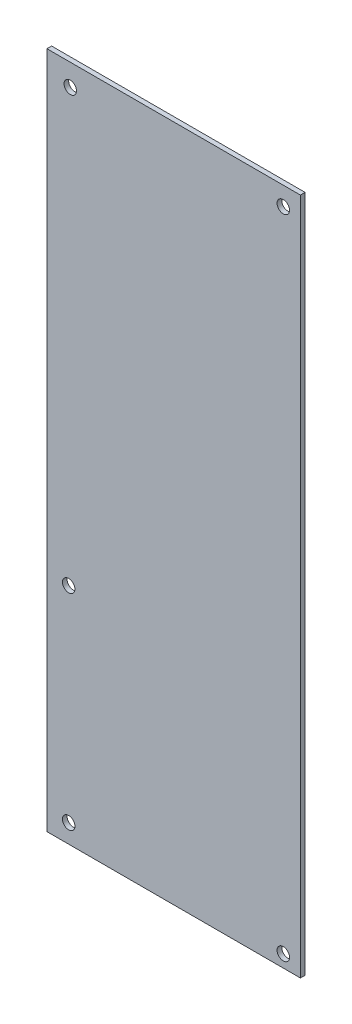
ISO-10303-21;
HEADER;
FILE_DESCRIPTION(('STEP AP214'),'2;1');
FILE_NAME('part.step','',(''),(''),'','','');
FILE_SCHEMA(('AUTOMOTIVE_DESIGN { 1 0 10303 214 1 1 1 1 }'));
ENDSEC;
DATA;
#1=APPLICATION_CONTEXT('core data for automotive mechanical design processes');
#2=APPLICATION_PROTOCOL_DEFINITION('international standard','automotive_design',2000,#1);
#3=PRODUCT_CONTEXT('',#1,'mechanical');
#4=PRODUCT('Part','Part','',(#3));
#5=PRODUCT_RELATED_PRODUCT_CATEGORY('part','',(#4));
#6=PRODUCT_DEFINITION_FORMATION('','',#4);
#7=PRODUCT_DEFINITION_CONTEXT('part definition',#1,'design');
#8=PRODUCT_DEFINITION('design','',#6,#7);
#9=PRODUCT_DEFINITION_SHAPE('','',#8);
#10=(LENGTH_UNIT() NAMED_UNIT(*) SI_UNIT(.MILLI.,.METRE.));
#11=(NAMED_UNIT(*) PLANE_ANGLE_UNIT() SI_UNIT($,.RADIAN.));
#12=(NAMED_UNIT(*) SI_UNIT($,.STERADIAN.) SOLID_ANGLE_UNIT());
#13=UNCERTAINTY_MEASURE_WITH_UNIT(LENGTH_MEASURE(1.E-05),#10,'distance_accuracy_value','');
#14=(GEOMETRIC_REPRESENTATION_CONTEXT(3) GLOBAL_UNCERTAINTY_ASSIGNED_CONTEXT((#13)) GLOBAL_UNIT_ASSIGNED_CONTEXT((#10,
#11,#12)) REPRESENTATION_CONTEXT('',''));
#15=CARTESIAN_POINT('',(0.,0.,0.));
#16=DIRECTION('',(0.,0.,1.));
#17=DIRECTION('',(1.,0.,0.));
#18=AXIS2_PLACEMENT_3D('',#15,#16,#17);
#19=CARTESIAN_POINT('',(0.,0.,1.5));
#20=DIRECTION('',(1.,0.,0.));
#21=DIRECTION('',(0.,0.,-1.));
#22=AXIS2_PLACEMENT_3D('',#19,#20,#21);
#23=PLANE('',#22);
#24=DIRECTION('',(0.,-1.,0.));
#25=VECTOR('',#24,1.);
#26=CARTESIAN_POINT('',(0.,0.,0.));
#27=LINE('',#26,#25);
#28=CARTESIAN_POINT('',(0.,218.,0.));
#29=VERTEX_POINT('',#28);
#30=CARTESIAN_POINT('',(0.,0.,0.));
#31=VERTEX_POINT('',#30);
#32=EDGE_CURVE('E96',#29,#31,#27,.T.);
#33=ORIENTED_EDGE('',*,*,#32,.T.);
#34=DIRECTION('',(0.,0.,-1.));
#35=VECTOR('',#34,1.);
#36=CARTESIAN_POINT('',(0.,0.,1.5));
#37=LINE('',#36,#35);
#38=CARTESIAN_POINT('',(0.,0.,1.5));
#39=VERTEX_POINT('',#38);
#40=EDGE_CURVE('E11',#39,#31,#37,.T.);
#41=ORIENTED_EDGE('',*,*,#40,.F.);
#42=DIRECTION('',(0.,-1.,0.));
#43=VECTOR('',#42,1.);
#44=CARTESIAN_POINT('',(0.,0.,1.5));
#45=LINE('',#44,#43);
#46=CARTESIAN_POINT('',(0.,218.,1.5));
#47=VERTEX_POINT('',#46);
#48=EDGE_CURVE('E84',#47,#39,#45,.T.);
#49=ORIENTED_EDGE('',*,*,#48,.F.);
#50=DIRECTION('',(0.,0.,-1.));
#51=VECTOR('',#50,1.);
#52=CARTESIAN_POINT('',(0.,218.,1.5));
#53=LINE('',#52,#51);
#54=EDGE_CURVE('E92',#47,#29,#53,.T.);
#55=ORIENTED_EDGE('',*,*,#54,.T.);
#56=EDGE_LOOP('',(#33,#41,#49,#55));
#57=FACE_BOUND('',#56,.T.);
#58=ADVANCED_FACE('F33',(#57),#23,.F.);
#59=CARTESIAN_POINT('',(0.,0.,1.5));
#60=DIRECTION('',(0.,1.,0.));
#61=DIRECTION('',(0.,0.,1.));
#62=AXIS2_PLACEMENT_3D('',#59,#60,#61);
#63=PLANE('',#62);
#64=DIRECTION('',(1.,0.,0.));
#65=VECTOR('',#64,1.);
#66=CARTESIAN_POINT('',(0.,0.,0.));
#67=LINE('',#66,#65);
#68=CARTESIAN_POINT('',(81.5,0.,0.));
#69=VERTEX_POINT('',#68);
#70=EDGE_CURVE('E88',#31,#69,#67,.T.);
#71=ORIENTED_EDGE('',*,*,#70,.T.);
#72=DIRECTION('',(0.,0.,-1.));
#73=VECTOR('',#72,1.);
#74=CARTESIAN_POINT('',(81.5,0.,1.5));
#75=LINE('',#74,#73);
#76=CARTESIAN_POINT('',(81.5,0.,1.5));
#77=VERTEX_POINT('',#76);
#78=EDGE_CURVE('E41',#77,#69,#75,.T.);
#79=ORIENTED_EDGE('',*,*,#78,.F.);
#80=DIRECTION('',(1.,0.,0.));
#81=VECTOR('',#80,1.);
#82=CARTESIAN_POINT('',(0.,0.,1.5));
#83=LINE('',#82,#81);
#84=EDGE_CURVE('E79',#39,#77,#83,.T.);
#85=ORIENTED_EDGE('',*,*,#84,.F.);
#86=ORIENTED_EDGE('',*,*,#40,.T.);
#87=EDGE_LOOP('',(#71,#79,#85,#86));
#88=FACE_BOUND('',#87,.T.);
#89=ADVANCED_FACE('F87',(#88),#63,.F.);
#90=CARTESIAN_POINT('',(81.5,0.,1.5));
#91=DIRECTION('',(-1.,0.,0.));
#92=DIRECTION('',(0.,0.,1.));
#93=AXIS2_PLACEMENT_3D('',#90,#91,#92);
#94=PLANE('',#93);
#95=DIRECTION('',(0.,1.,0.));
#96=VECTOR('',#95,1.);
#97=CARTESIAN_POINT('',(81.5,0.,0.));
#98=LINE('',#97,#96);
#99=CARTESIAN_POINT('',(81.5,218.,0.));
#100=VERTEX_POINT('',#99);
#101=EDGE_CURVE('E66',#69,#100,#98,.T.);
#102=ORIENTED_EDGE('',*,*,#101,.T.);
#103=DIRECTION('',(0.,0.,-1.));
#104=VECTOR('',#103,1.);
#105=CARTESIAN_POINT('',(81.5,218.,1.5));
#106=LINE('',#105,#104);
#107=CARTESIAN_POINT('',(81.5,218.,1.5));
#108=VERTEX_POINT('',#107);
#109=EDGE_CURVE('E89',#108,#100,#106,.T.);
#110=ORIENTED_EDGE('',*,*,#109,.F.);
#111=DIRECTION('',(0.,1.,0.));
#112=VECTOR('',#111,1.);
#113=CARTESIAN_POINT('',(81.5,0.,1.5));
#114=LINE('',#113,#112);
#115=EDGE_CURVE('E82',#77,#108,#114,.T.);
#116=ORIENTED_EDGE('',*,*,#115,.F.);
#117=ORIENTED_EDGE('',*,*,#78,.T.);
#118=EDGE_LOOP('',(#102,#110,#116,#117));
#119=FACE_BOUND('',#118,.T.);
#120=ADVANCED_FACE('F90',(#119),#94,.F.);
#121=CARTESIAN_POINT('',(0.,218.,1.5));
#122=DIRECTION('',(0.,-1.,0.));
#123=DIRECTION('',(0.,0.,-1.));
#124=AXIS2_PLACEMENT_3D('',#121,#122,#123);
#125=PLANE('',#124);
#126=DIRECTION('',(-1.,0.,0.));
#127=VECTOR('',#126,1.);
#128=CARTESIAN_POINT('',(0.,218.,0.));
#129=LINE('',#128,#127);
#130=EDGE_CURVE('E72',#100,#29,#129,.T.);
#131=ORIENTED_EDGE('',*,*,#130,.T.);
#132=ORIENTED_EDGE('',*,*,#54,.F.);
#133=DIRECTION('',(-1.,0.,0.));
#134=VECTOR('',#133,1.);
#135=CARTESIAN_POINT('',(0.,218.,1.5));
#136=LINE('',#135,#134);
#137=EDGE_CURVE('E49',#108,#47,#136,.T.);
#138=ORIENTED_EDGE('',*,*,#137,.F.);
#139=ORIENTED_EDGE('',*,*,#109,.T.);
#140=EDGE_LOOP('',(#131,#132,#138,#139));
#141=FACE_BOUND('',#140,.T.);
#142=ADVANCED_FACE('F104',(#141),#125,.F.);
#143=CARTESIAN_POINT('',(0.,0.,1.5));
#144=DIRECTION('',(0.,0.,-1.));
#145=DIRECTION('',(-1.,0.,0.));
#146=AXIS2_PLACEMENT_3D('',#143,#144,#145);
#147=PLANE('',#146);
#148=CARTESIAN_POINT('',(7.,72.,1.5));
#149=DIRECTION('',(0.,0.,1.));
#150=DIRECTION('',(1.,0.,0.));
#151=AXIS2_PLACEMENT_3D('',#148,#149,#150);
#152=CIRCLE('',#151,2.);
#153=CARTESIAN_POINT('',(9.,72.,1.5));
#154=VERTEX_POINT('',#153);
#155=EDGE_CURVE('E128',#154,#154,#152,.T.);
#156=ORIENTED_EDGE('',*,*,#155,.F.);
#157=EDGE_LOOP('',(#156));
#158=FACE_BOUND('',#157,.T.);
#159=CARTESIAN_POINT('',(76.,4.,1.5));
#160=DIRECTION('',(0.,0.,1.));
#161=DIRECTION('',(1.,0.,0.));
#162=AXIS2_PLACEMENT_3D('',#159,#160,#161);
#163=CIRCLE('',#162,2.);
#164=CARTESIAN_POINT('',(78.,4.,1.5));
#165=VERTEX_POINT('',#164);
#166=EDGE_CURVE('E134',#165,#165,#163,.T.);
#167=ORIENTED_EDGE('',*,*,#166,.F.);
#168=EDGE_LOOP('',(#167));
#169=FACE_BOUND('',#168,.T.);
#170=CARTESIAN_POINT('',(7.,6.,1.5));
#171=DIRECTION('',(0.,0.,1.));
#172=DIRECTION('',(1.,0.,0.));
#173=AXIS2_PLACEMENT_3D('',#170,#171,#172);
#174=CIRCLE('',#173,2.);
#175=CARTESIAN_POINT('',(9.,6.,1.5));
#176=VERTEX_POINT('',#175);
#177=EDGE_CURVE('E116',#176,#176,#174,.T.);
#178=ORIENTED_EDGE('',*,*,#177,.F.);
#179=EDGE_LOOP('',(#178));
#180=FACE_BOUND('',#179,.T.);
#181=CARTESIAN_POINT('',(76.,212.,1.5));
#182=DIRECTION('',(0.,0.,1.));
#183=DIRECTION('',(1.,0.,0.));
#184=AXIS2_PLACEMENT_3D('',#181,#182,#183);
#185=CIRCLE('',#184,2.);
#186=CARTESIAN_POINT('',(78.,212.,1.5));
#187=VERTEX_POINT('',#186);
#188=EDGE_CURVE('E123',#187,#187,#185,.T.);
#189=ORIENTED_EDGE('',*,*,#188,.F.);
#190=EDGE_LOOP('',(#189));
#191=FACE_BOUND('',#190,.T.);
#192=CARTESIAN_POINT('',(7.5,211.,1.5));
#193=DIRECTION('',(0.,0.,1.));
#194=DIRECTION('',(1.,0.,0.));
#195=AXIS2_PLACEMENT_3D('',#192,#193,#194);
#196=CIRCLE('',#195,2.);
#197=CARTESIAN_POINT('',(9.5,211.,1.5));
#198=VERTEX_POINT('',#197);
#199=EDGE_CURVE('E110',#198,#198,#196,.T.);
#200=ORIENTED_EDGE('',*,*,#199,.F.);
#201=EDGE_LOOP('',(#200));
#202=FACE_BOUND('',#201,.T.);
#203=ORIENTED_EDGE('',*,*,#48,.T.);
#204=ORIENTED_EDGE('',*,*,#84,.T.);
#205=ORIENTED_EDGE('',*,*,#115,.T.);
#206=ORIENTED_EDGE('',*,*,#137,.T.);
#207=EDGE_LOOP('',(#203,#204,#205,#206));
#208=FACE_BOUND('',#207,.T.);
#209=ADVANCED_FACE('F80',(#158,#169,#180,#191,#202,#208),#147,.F.);
#210=CARTESIAN_POINT('',(0.,0.,0.));
#211=DIRECTION('',(0.,0.,-1.));
#212=DIRECTION('',(-1.,0.,0.));
#213=AXIS2_PLACEMENT_3D('',#210,#211,#212);
#214=PLANE('',#213);
#215=CARTESIAN_POINT('',(7.,72.,0.));
#216=DIRECTION('',(0.,0.,1.));
#217=DIRECTION('',(1.,0.,0.));
#218=AXIS2_PLACEMENT_3D('',#215,#216,#217);
#219=CIRCLE('',#218,2.);
#220=CARTESIAN_POINT('',(9.,72.,0.));
#221=VERTEX_POINT('',#220);
#222=EDGE_CURVE('E131',#221,#221,#219,.T.);
#223=ORIENTED_EDGE('',*,*,#222,.T.);
#224=EDGE_LOOP('',(#223));
#225=FACE_BOUND('',#224,.T.);
#226=CARTESIAN_POINT('',(76.,4.,0.));
#227=DIRECTION('',(0.,0.,1.));
#228=DIRECTION('',(1.,0.,0.));
#229=AXIS2_PLACEMENT_3D('',#226,#227,#228);
#230=CIRCLE('',#229,2.);
#231=CARTESIAN_POINT('',(78.,4.,0.));
#232=VERTEX_POINT('',#231);
#233=EDGE_CURVE('E120',#232,#232,#230,.T.);
#234=ORIENTED_EDGE('',*,*,#233,.T.);
#235=EDGE_LOOP('',(#234));
#236=FACE_BOUND('',#235,.T.);
#237=CARTESIAN_POINT('',(7.,6.,0.));
#238=DIRECTION('',(0.,0.,1.));
#239=DIRECTION('',(1.,0.,0.));
#240=AXIS2_PLACEMENT_3D('',#237,#238,#239);
#241=CIRCLE('',#240,2.);
#242=CARTESIAN_POINT('',(9.,6.,0.));
#243=VERTEX_POINT('',#242);
#244=EDGE_CURVE('E119',#243,#243,#241,.T.);
#245=ORIENTED_EDGE('',*,*,#244,.T.);
#246=EDGE_LOOP('',(#245));
#247=FACE_BOUND('',#246,.T.);
#248=CARTESIAN_POINT('',(76.,212.,0.));
#249=DIRECTION('',(0.,0.,1.));
#250=DIRECTION('',(1.,0.,0.));
#251=AXIS2_PLACEMENT_3D('',#248,#249,#250);
#252=CIRCLE('',#251,2.);
#253=CARTESIAN_POINT('',(78.,212.,0.));
#254=VERTEX_POINT('',#253);
#255=EDGE_CURVE('E113',#254,#254,#252,.T.);
#256=ORIENTED_EDGE('',*,*,#255,.T.);
#257=EDGE_LOOP('',(#256));
#258=FACE_BOUND('',#257,.T.);
#259=CARTESIAN_POINT('',(7.5,211.,0.));
#260=DIRECTION('',(0.,0.,1.));
#261=DIRECTION('',(1.,0.,0.));
#262=AXIS2_PLACEMENT_3D('',#259,#260,#261);
#263=CIRCLE('',#262,2.);
#264=CARTESIAN_POINT('',(9.5,211.,0.));
#265=VERTEX_POINT('',#264);
#266=EDGE_CURVE('E99',#265,#265,#263,.T.);
#267=ORIENTED_EDGE('',*,*,#266,.T.);
#268=EDGE_LOOP('',(#267));
#269=FACE_BOUND('',#268,.T.);
#270=ORIENTED_EDGE('',*,*,#32,.F.);
#271=ORIENTED_EDGE('',*,*,#130,.F.);
#272=ORIENTED_EDGE('',*,*,#101,.F.);
#273=ORIENTED_EDGE('',*,*,#70,.F.);
#274=EDGE_LOOP('',(#270,#271,#272,#273));
#275=FACE_BOUND('',#274,.T.);
#276=ADVANCED_FACE('F107',(#225,#236,#247,#258,#269,#275),#214,.T.);
#277=CARTESIAN_POINT('',(7.5,211.,0.));
#278=DIRECTION('',(0.,0.,1.));
#279=DIRECTION('',(1.,0.,0.));
#280=AXIS2_PLACEMENT_3D('',#277,#278,#279);
#281=CYLINDRICAL_SURFACE('',#280,2.);
#282=ORIENTED_EDGE('',*,*,#266,.F.);
#283=EDGE_LOOP('',(#282));
#284=FACE_BOUND('',#283,.T.);
#285=ORIENTED_EDGE('',*,*,#199,.T.);
#286=EDGE_LOOP('',(#285));
#287=FACE_BOUND('',#286,.T.);
#288=ADVANCED_FACE('F160',(#284,#287),#281,.F.);
#289=CARTESIAN_POINT('',(76.,212.,0.));
#290=DIRECTION('',(0.,0.,1.));
#291=DIRECTION('',(1.,0.,0.));
#292=AXIS2_PLACEMENT_3D('',#289,#290,#291);
#293=CYLINDRICAL_SURFACE('',#292,2.);
#294=ORIENTED_EDGE('',*,*,#255,.F.);
#295=EDGE_LOOP('',(#294));
#296=FACE_BOUND('',#295,.T.);
#297=ORIENTED_EDGE('',*,*,#188,.T.);
#298=EDGE_LOOP('',(#297));
#299=FACE_BOUND('',#298,.T.);
#300=ADVANCED_FACE('F162',(#296,#299),#293,.F.);
#301=CARTESIAN_POINT('',(7.,6.,0.));
#302=DIRECTION('',(0.,0.,1.));
#303=DIRECTION('',(1.,0.,0.));
#304=AXIS2_PLACEMENT_3D('',#301,#302,#303);
#305=CYLINDRICAL_SURFACE('',#304,2.);
#306=ORIENTED_EDGE('',*,*,#244,.F.);
#307=EDGE_LOOP('',(#306));
#308=FACE_BOUND('',#307,.T.);
#309=ORIENTED_EDGE('',*,*,#177,.T.);
#310=EDGE_LOOP('',(#309));
#311=FACE_BOUND('',#310,.T.);
#312=ADVANCED_FACE('F146',(#308,#311),#305,.F.);
#313=CARTESIAN_POINT('',(76.,4.,0.));
#314=DIRECTION('',(0.,0.,1.));
#315=DIRECTION('',(1.,0.,0.));
#316=AXIS2_PLACEMENT_3D('',#313,#314,#315);
#317=CYLINDRICAL_SURFACE('',#316,2.);
#318=ORIENTED_EDGE('',*,*,#233,.F.);
#319=EDGE_LOOP('',(#318));
#320=FACE_BOUND('',#319,.T.);
#321=ORIENTED_EDGE('',*,*,#166,.T.);
#322=EDGE_LOOP('',(#321));
#323=FACE_BOUND('',#322,.T.);
#324=ADVANCED_FACE('F142',(#320,#323),#317,.F.);
#325=CARTESIAN_POINT('',(7.,72.,0.));
#326=DIRECTION('',(0.,0.,1.));
#327=DIRECTION('',(1.,0.,0.));
#328=AXIS2_PLACEMENT_3D('',#325,#326,#327);
#329=CYLINDRICAL_SURFACE('',#328,2.);
#330=ORIENTED_EDGE('',*,*,#222,.F.);
#331=EDGE_LOOP('',(#330));
#332=FACE_BOUND('',#331,.T.);
#333=ORIENTED_EDGE('',*,*,#155,.T.);
#334=EDGE_LOOP('',(#333));
#335=FACE_BOUND('',#334,.T.);
#336=ADVANCED_FACE('F145',(#332,#335),#329,.F.);
#337=CLOSED_SHELL('',(#58,#89,#120,#142,#209,#276,#288,#300,#312,#324,#336));
#338=MANIFOLD_SOLID_BREP('B2',#337);
#339=ADVANCED_BREP_SHAPE_REPRESENTATION('',(#18,#338),#14);
#340=SHAPE_DEFINITION_REPRESENTATION(#9,#339);
ENDSEC;
END-ISO-10303-21;
